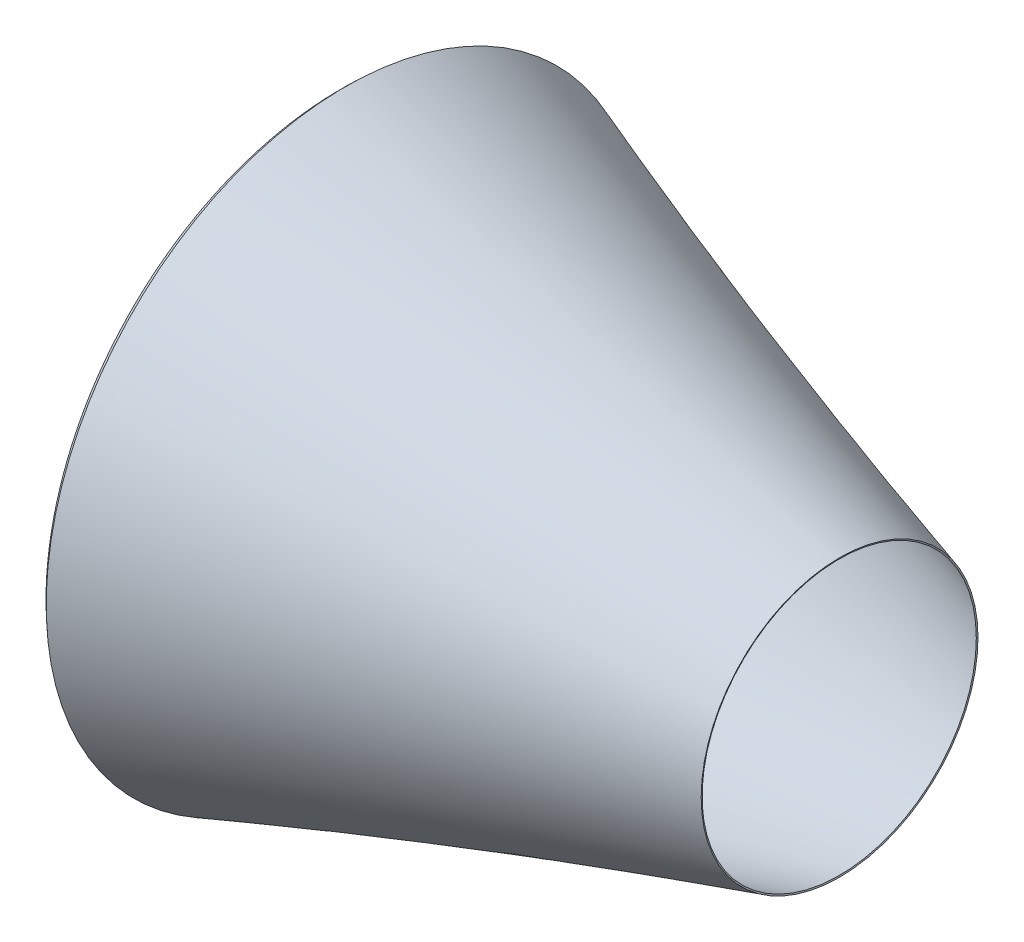
ISO-10303-21;
HEADER;
FILE_DESCRIPTION(('STEP AP214'),'2;1');
FILE_NAME('part.step','',(''),(''),'','','');
FILE_SCHEMA(('AUTOMOTIVE_DESIGN { 1 0 10303 214 1 1 1 1 }'));
ENDSEC;
DATA;
#1=APPLICATION_CONTEXT('core data for automotive mechanical design processes');
#2=APPLICATION_PROTOCOL_DEFINITION('international standard','automotive_design',2000,#1);
#3=PRODUCT_CONTEXT('',#1,'mechanical');
#4=PRODUCT('Part','Part','',(#3));
#5=PRODUCT_RELATED_PRODUCT_CATEGORY('part','',(#4));
#6=PRODUCT_DEFINITION_FORMATION('','',#4);
#7=PRODUCT_DEFINITION_CONTEXT('part definition',#1,'design');
#8=PRODUCT_DEFINITION('design','',#6,#7);
#9=PRODUCT_DEFINITION_SHAPE('','',#8);
#10=(LENGTH_UNIT() NAMED_UNIT(*) SI_UNIT(.MILLI.,.METRE.));
#11=(NAMED_UNIT(*) PLANE_ANGLE_UNIT() SI_UNIT($,.RADIAN.));
#12=(NAMED_UNIT(*) SI_UNIT($,.STERADIAN.) SOLID_ANGLE_UNIT());
#13=UNCERTAINTY_MEASURE_WITH_UNIT(LENGTH_MEASURE(1.E-05),#10,'distance_accuracy_value','');
#14=(GEOMETRIC_REPRESENTATION_CONTEXT(3) GLOBAL_UNCERTAINTY_ASSIGNED_CONTEXT((#13)) GLOBAL_UNIT_ASSIGNED_CONTEXT((#10,
#11,#12)) REPRESENTATION_CONTEXT('',''));
#15=CARTESIAN_POINT('',(0.,0.,0.));
#16=DIRECTION('',(0.,0.,1.));
#17=DIRECTION('',(1.,0.,0.));
#18=AXIS2_PLACEMENT_3D('',#15,#16,#17);
#19=CARTESIAN_POINT('',(113.164522355811,0.,0.));
#20=DIRECTION('',(-1.,0.,0.));
#21=DIRECTION('',(0.,0.,1.));
#22=AXIS2_PLACEMENT_3D('',#19,#20,#21);
#23=PLANE('',#22);
#24=CARTESIAN_POINT('',(113.164522355811,0.,0.));
#25=DIRECTION('',(1.,0.,0.));
#26=DIRECTION('',(0.,0.,-1.));
#27=AXIS2_PLACEMENT_3D('',#24,#25,#26);
#28=CIRCLE('',#27,995.);
#29=CARTESIAN_POINT('',(113.164522355811,0.,-995.));
#30=VERTEX_POINT('',#29);
#31=EDGE_CURVE('E51',#30,#30,#28,.T.);
#32=ORIENTED_EDGE('',*,*,#31,.F.);
#33=EDGE_LOOP('',(#32));
#34=FACE_BOUND('',#33,.T.);
#35=CARTESIAN_POINT('',(113.164522355811,0.,0.));
#36=DIRECTION('',(1.,0.,0.));
#37=DIRECTION('',(0.,0.,-1.));
#38=AXIS2_PLACEMENT_3D('',#35,#36,#37);
#39=CIRCLE('',#38,1000.);
#40=CARTESIAN_POINT('',(113.164522355811,0.,-1000.));
#41=VERTEX_POINT('',#40);
#42=EDGE_CURVE('E114',#41,#41,#39,.T.);
#43=ORIENTED_EDGE('',*,*,#42,.T.);
#44=EDGE_LOOP('',(#43));
#45=FACE_BOUND('',#44,.T.);
#46=ADVANCED_FACE('F33',(#34,#45),#23,.F.);
#47=CARTESIAN_POINT('',(1800.,0.,0.));
#48=DIRECTION('',(1.,0.,0.));
#49=DIRECTION('',(0.,0.,-1.));
#50=AXIS2_PLACEMENT_3D('',#47,#48,#49);
#51=CONICAL_SURFACE('',#50,500.,1.29077649346346);
#52=CARTESIAN_POINT('',(1801.3818735472,0.,0.));
#53=DIRECTION('',(1.,0.,0.));
#54=DIRECTION('',(0.,1.,0.));
#55=AXIS2_PLACEMENT_3D('',#52,#53,#54);
#56=CIRCLE('',#55,504.805249785343);
#57=CARTESIAN_POINT('',(1801.3818735472,504.805249785343,0.));
#58=VERTEX_POINT('',#57);
#59=EDGE_CURVE('E10',#58,#58,#56,.T.);
#60=ORIENTED_EDGE('',*,*,#59,.T.);
#61=EDGE_LOOP('',(#60));
#62=FACE_BOUND('',#61,.T.);
#63=CARTESIAN_POINT('',(1800.,0.,0.));
#64=DIRECTION('',(1.,0.,0.));
#65=DIRECTION('',(0.,0.,-1.));
#66=AXIS2_PLACEMENT_3D('',#63,#64,#65);
#67=CIRCLE('',#66,500.);
#68=CARTESIAN_POINT('',(1800.,0.,-500.));
#69=VERTEX_POINT('',#68);
#70=EDGE_CURVE('E36',#69,#69,#67,.T.);
#71=ORIENTED_EDGE('',*,*,#70,.F.);
#72=EDGE_LOOP('',(#71));
#73=FACE_BOUND('',#72,.T.);
#74=ADVANCED_FACE('F150',(#62,#73),#51,.F.);
#75=CARTESIAN_POINT('',(1800.,500.,0.));
#76=CARTESIAN_POINT('',(889.916532697749,761.717980415645,0.));
#77=CARTESIAN_POINT('',(-8.89916532697749,1088.52120169807,0.));
#78=CARTESIAN_POINT('',(-17.798330653955,1091.75687715631,0.));
#79=B_SPLINE_CURVE_WITH_KNOTS('',2,(#75,#76,#77,#78),.UNSPECIFIED.,.F.,.F.,(3,1,3),(0.,1.,1.01),.UNSPECIFIED.);
#80=CARTESIAN_POINT('',(0.,0.,0.));
#81=DIRECTION('',(1.,0.,0.));
#82=AXIS1_PLACEMENT('',#80,#81);
#83=SURFACE_OF_REVOLUTION('',#79,#82);
#84=OFFSET_SURFACE('',#83,-5.,.F.);
#85=CARTESIAN_POINT('',(-1.05851749213478,0.,0.));
#86=DIRECTION('',(1.,0.,0.));
#87=DIRECTION('',(0.,0.,-1.));
#88=AXIS2_PLACEMENT_3D('',#85,#86,#87);
#89=CIRCLE('',#88,1090.99064022478);
#90=CARTESIAN_POINT('',(-1.05851749213478,0.,-1090.99064022478));
#91=VERTEX_POINT('',#90);
#92=EDGE_CURVE('E40',#91,#91,#89,.T.);
#93=ORIENTED_EDGE('',*,*,#92,.T.);
#94=EDGE_LOOP('',(#93));
#95=FACE_BOUND('',#94,.T.);
#96=ORIENTED_EDGE('',*,*,#59,.F.);
#97=EDGE_LOOP('',(#96));
#98=FACE_BOUND('',#97,.T.);
#99=ADVANCED_FACE('F70',(#95,#98),#84,.F.);
#100=CARTESIAN_POINT('',(2.22197520965086,1087.21726406628,0.));
#101=CARTESIAN_POINT('',(1.11098760482543,1086.25139515306,0.));
#102=CARTESIAN_POINT('',(-77.6020768194913,1017.81993681633,0.));
#103=CARTESIAN_POINT('',(0.776020768194913,949.321800631837,0.));
#104=CARTESIAN_POINT('',(1.55204153638983,948.643601263673,0.));
#105=B_SPLINE_CURVE_WITH_KNOTS('',2,(#100,#101,#102,#103,#104),.UNSPECIFIED.,.F.,.F.,(3,1,1,3),
(-0.0143164674240572,0.,1.,1.01),.UNSPECIFIED.);
#106=CARTESIAN_POINT('',(0.,0.,0.));
#107=DIRECTION('',(1.,0.,0.));
#108=AXIS1_PLACEMENT('',#106,#107);
#109=SURFACE_OF_REVOLUTION('',#105,#108);
#110=OFFSET_SURFACE('',#109,-5.,.F.);
#111=CARTESIAN_POINT('',(-1.87696997164193,0.,0.));
#112=DIRECTION('',(1.,0.,0.));
#113=DIRECTION('',(0.,0.,-1.));
#114=AXIS2_PLACEMENT_3D('',#111,#112,#113);
#115=CIRCLE('',#114,945.);
#116=CARTESIAN_POINT('',(-1.87696997164193,0.,-945.));
#117=VERTEX_POINT('',#116);
#118=EDGE_CURVE('E45',#117,#117,#115,.T.);
#119=ORIENTED_EDGE('',*,*,#118,.T.);
#120=EDGE_LOOP('',(#119));
#121=FACE_BOUND('',#120,.T.);
#122=ORIENTED_EDGE('',*,*,#92,.F.);
#123=EDGE_LOOP('',(#122));
#124=FACE_BOUND('',#123,.T.);
#125=ADVANCED_FACE('F71',(#121,#124),#110,.F.);
#126=CARTESIAN_POINT('',(0.,0.,0.));
#127=DIRECTION('',(1.,0.,0.));
#128=DIRECTION('',(0.,0.,-1.));
#129=AXIS2_PLACEMENT_3D('',#126,#127,#128);
#130=CYLINDRICAL_SURFACE('',#129,945.);
#131=CARTESIAN_POINT('',(29.2497686688984,0.,0.));
#132=DIRECTION('',(1.,0.,0.));
#133=DIRECTION('',(0.,0.,-1.));
#134=AXIS2_PLACEMENT_3D('',#131,#132,#133);
#135=CIRCLE('',#134,945.);
#136=CARTESIAN_POINT('',(29.2497686688984,0.,-945.));
#137=VERTEX_POINT('',#136);
#138=EDGE_CURVE('E54',#137,#137,#135,.T.);
#139=ORIENTED_EDGE('',*,*,#138,.T.);
#140=EDGE_LOOP('',(#139));
#141=FACE_BOUND('',#140,.T.);
#142=ORIENTED_EDGE('',*,*,#118,.F.);
#143=EDGE_LOOP('',(#142));
#144=FACE_BOUND('',#143,.T.);
#145=ADVANCED_FACE('F74',(#141,#144),#130,.F.);
#146=CARTESIAN_POINT('',(29.9346446732899,0.,0.));
#147=DIRECTION('',(1.,0.,0.));
#148=DIRECTION('',(0.,0.,-1.));
#149=AXIS2_PLACEMENT_3D('',#146,#147,#148);
#150=CONICAL_SURFACE('',#149,949.194219664939,1.40893440740853);
#151=CARTESIAN_POINT('',(37.4142910247093,0.,0.));
#152=DIRECTION('',(1.,0.,0.));
#153=DIRECTION('',(0.,0.,-1.));
#154=AXIS2_PLACEMENT_3D('',#151,#152,#153);
#155=CIRCLE('',#154,995.);
#156=CARTESIAN_POINT('',(37.4142910247093,0.,-995.));
#157=VERTEX_POINT('',#156);
#158=EDGE_CURVE('E49',#157,#157,#155,.T.);
#159=ORIENTED_EDGE('',*,*,#158,.T.);
#160=EDGE_LOOP('',(#159));
#161=FACE_BOUND('',#160,.T.);
#162=ORIENTED_EDGE('',*,*,#138,.F.);
#163=EDGE_LOOP('',(#162));
#164=FACE_BOUND('',#163,.T.);
#165=ADVANCED_FACE('F80',(#161,#164),#150,.F.);
#166=CARTESIAN_POINT('',(0.,0.,0.));
#167=DIRECTION('',(1.,0.,0.));
#168=DIRECTION('',(0.,0.,-1.));
#169=AXIS2_PLACEMENT_3D('',#166,#167,#168);
#170=CYLINDRICAL_SURFACE('',#169,995.);
#171=ORIENTED_EDGE('',*,*,#31,.T.);
#172=EDGE_LOOP('',(#171));
#173=FACE_BOUND('',#172,.T.);
#174=ORIENTED_EDGE('',*,*,#158,.F.);
#175=EDGE_LOOP('',(#174));
#176=FACE_BOUND('',#175,.T.);
#177=ADVANCED_FACE('F84',(#173,#176),#170,.F.);
#178=CARTESIAN_POINT('',(1800.,500.,0.));
#179=CARTESIAN_POINT('',(889.916532697749,761.717980415645,0.));
#180=CARTESIAN_POINT('',(0.,1085.28552623983,0.));
#181=B_SPLINE_CURVE_WITH_KNOTS('',2,(#178,#179,#180),.UNSPECIFIED.,.F.,.F.,(3,3),(0.,1.),.UNSPECIFIED.);
#182=CARTESIAN_POINT('',(0.,0.,0.));
#183=DIRECTION('',(1.,0.,0.));
#184=AXIS1_PLACEMENT('',#182,#183);
#185=SURFACE_OF_REVOLUTION('',#181,#184);
#186=CARTESIAN_POINT('',(0.,0.,0.));
#187=DIRECTION('',(1.,0.,0.));
#188=DIRECTION('',(0.,0.,-1.));
#189=AXIS2_PLACEMENT_3D('',#186,#187,#188);
#190=CIRCLE('',#189,1085.28552623983);
#191=CARTESIAN_POINT('',(0.,0.,-1085.28552623983));
#192=VERTEX_POINT('',#191);
#193=EDGE_CURVE('E128',#192,#192,#190,.T.);
#194=ORIENTED_EDGE('',*,*,#193,.F.);
#195=EDGE_LOOP('',(#194));
#196=FACE_BOUND('',#195,.T.);
#197=ORIENTED_EDGE('',*,*,#70,.T.);
#198=EDGE_LOOP('',(#197));
#199=FACE_BOUND('',#198,.T.);
#200=ADVANCED_FACE('F88',(#196,#199),#185,.T.);
#201=CARTESIAN_POINT('',(0.,1085.28552623983,0.));
#202=CARTESIAN_POINT('',(-77.6020768194913,1017.81993681633,0.));
#203=CARTESIAN_POINT('',(0.,950.,0.));
#204=B_SPLINE_CURVE_WITH_KNOTS('',2,(#201,#202,#203),.UNSPECIFIED.,.F.,.F.,(3,3),(0.,1.),.UNSPECIFIED.);
#205=CARTESIAN_POINT('',(0.,0.,0.));
#206=DIRECTION('',(1.,0.,0.));
#207=AXIS1_PLACEMENT('',#205,#206);
#208=SURFACE_OF_REVOLUTION('',#204,#207);
#209=CARTESIAN_POINT('',(0.,0.,0.));
#210=DIRECTION('',(1.,0.,0.));
#211=DIRECTION('',(0.,0.,-1.));
#212=AXIS2_PLACEMENT_3D('',#209,#210,#211);
#213=CIRCLE('',#212,950.);
#214=CARTESIAN_POINT('',(0.,0.,-950.));
#215=VERTEX_POINT('',#214);
#216=EDGE_CURVE('E126',#215,#215,#213,.T.);
#217=ORIENTED_EDGE('',*,*,#216,.F.);
#218=EDGE_LOOP('',(#217));
#219=FACE_BOUND('',#218,.T.);
#220=ORIENTED_EDGE('',*,*,#193,.T.);
#221=EDGE_LOOP('',(#220));
#222=FACE_BOUND('',#221,.T.);
#223=ADVANCED_FACE('F101',(#219,#222),#208,.T.);
#224=CARTESIAN_POINT('',(0.,0.,0.));
#225=DIRECTION('',(1.,0.,0.));
#226=DIRECTION('',(0.,0.,-1.));
#227=AXIS2_PLACEMENT_3D('',#224,#225,#226);
#228=CYLINDRICAL_SURFACE('',#227,950.);
#229=CARTESIAN_POINT('',(25.,0.,0.));
#230=DIRECTION('',(1.,0.,0.));
#231=DIRECTION('',(0.,0.,-1.));
#232=AXIS2_PLACEMENT_3D('',#229,#230,#231);
#233=CIRCLE('',#232,950.);
#234=CARTESIAN_POINT('',(25.,0.,-950.));
#235=VERTEX_POINT('',#234);
#236=EDGE_CURVE('E120',#235,#235,#233,.T.);
#237=ORIENTED_EDGE('',*,*,#236,.F.);
#238=EDGE_LOOP('',(#237));
#239=FACE_BOUND('',#238,.T.);
#240=ORIENTED_EDGE('',*,*,#216,.T.);
#241=EDGE_LOOP('',(#240));
#242=FACE_BOUND('',#241,.T.);
#243=ADVANCED_FACE('F97',(#239,#242),#228,.T.);
#244=CARTESIAN_POINT('',(25.,0.,0.));
#245=DIRECTION('',(1.,0.,0.));
#246=DIRECTION('',(0.,0.,-1.));
#247=AXIS2_PLACEMENT_3D('',#244,#245,#246);
#248=CONICAL_SURFACE('',#247,950.,1.40893440740853);
#249=CARTESIAN_POINT('',(33.1645223558109,0.,0.));
#250=DIRECTION('',(1.,0.,0.));
#251=DIRECTION('',(0.,0.,-1.));
#252=AXIS2_PLACEMENT_3D('',#249,#250,#251);
#253=CIRCLE('',#252,1000.);
#254=CARTESIAN_POINT('',(33.1645223558109,0.,-1000.));
#255=VERTEX_POINT('',#254);
#256=EDGE_CURVE('E121',#255,#255,#253,.T.);
#257=ORIENTED_EDGE('',*,*,#256,.F.);
#258=EDGE_LOOP('',(#257));
#259=FACE_BOUND('',#258,.T.);
#260=ORIENTED_EDGE('',*,*,#236,.T.);
#261=EDGE_LOOP('',(#260));
#262=FACE_BOUND('',#261,.T.);
#263=ADVANCED_FACE('F93',(#259,#262),#248,.T.);
#264=CARTESIAN_POINT('',(0.,0.,0.));
#265=DIRECTION('',(1.,0.,0.));
#266=DIRECTION('',(0.,0.,-1.));
#267=AXIS2_PLACEMENT_3D('',#264,#265,#266);
#268=CYLINDRICAL_SURFACE('',#267,1000.);
#269=ORIENTED_EDGE('',*,*,#42,.F.);
#270=EDGE_LOOP('',(#269));
#271=FACE_BOUND('',#270,.T.);
#272=ORIENTED_EDGE('',*,*,#256,.T.);
#273=EDGE_LOOP('',(#272));
#274=FACE_BOUND('',#273,.T.);
#275=ADVANCED_FACE('F90',(#271,#274),#268,.T.);
#276=CLOSED_SHELL('',(#46,#74,#99,#125,#145,#165,#177,#200,#223,#243,#263,#275));
#277=MANIFOLD_SOLID_BREP('B2',#276);
#278=ADVANCED_BREP_SHAPE_REPRESENTATION('',(#18,#277),#14);
#279=SHAPE_DEFINITION_REPRESENTATION(#9,#278);
ENDSEC;
END-ISO-10303-21;
